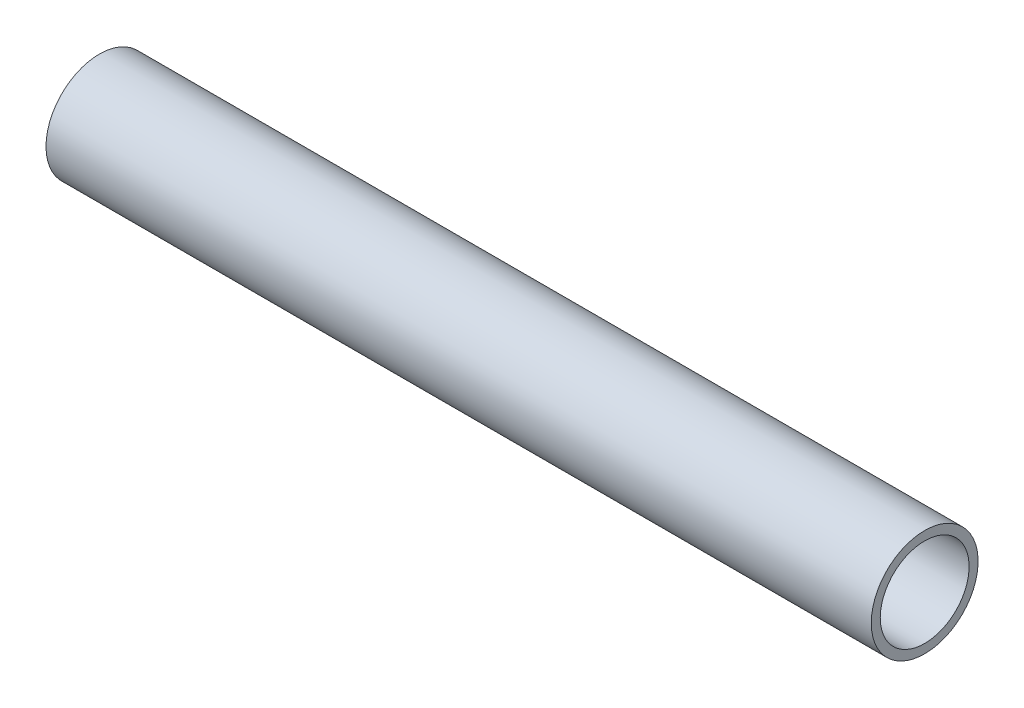
ISO-10303-21;
HEADER;
FILE_DESCRIPTION(('STEP AP214'),'2;1');
FILE_NAME('part.step','',(''),(''),'','','');
FILE_SCHEMA(('AUTOMOTIVE_DESIGN { 1 0 10303 214 1 1 1 1 }'));
ENDSEC;
DATA;
#1=APPLICATION_CONTEXT('core data for automotive mechanical design processes');
#2=APPLICATION_PROTOCOL_DEFINITION('international standard','automotive_design',2000,#1);
#3=PRODUCT_CONTEXT('',#1,'mechanical');
#4=PRODUCT('Part','Part','',(#3));
#5=PRODUCT_RELATED_PRODUCT_CATEGORY('part','',(#4));
#6=PRODUCT_DEFINITION_FORMATION('','',#4);
#7=PRODUCT_DEFINITION_CONTEXT('part definition',#1,'design');
#8=PRODUCT_DEFINITION('design','',#6,#7);
#9=PRODUCT_DEFINITION_SHAPE('','',#8);
#10=(LENGTH_UNIT() NAMED_UNIT(*) SI_UNIT(.MILLI.,.METRE.));
#11=(NAMED_UNIT(*) PLANE_ANGLE_UNIT() SI_UNIT($,.RADIAN.));
#12=(NAMED_UNIT(*) SI_UNIT($,.STERADIAN.) SOLID_ANGLE_UNIT());
#13=UNCERTAINTY_MEASURE_WITH_UNIT(LENGTH_MEASURE(1.E-05),#10,'distance_accuracy_value','');
#14=(GEOMETRIC_REPRESENTATION_CONTEXT(3) GLOBAL_UNCERTAINTY_ASSIGNED_CONTEXT((#13)) GLOBAL_UNIT_ASSIGNED_CONTEXT((#10,
#11,#12)) REPRESENTATION_CONTEXT('',''));
#15=CARTESIAN_POINT('',(0.,0.,0.));
#16=DIRECTION('',(0.,0.,1.));
#17=DIRECTION('',(1.,0.,0.));
#18=AXIS2_PLACEMENT_3D('',#15,#16,#17);
#19=CARTESIAN_POINT('',(25.2027542670464,668.699839019212,0.));
#20=DIRECTION('',(1.,0.,0.));
#21=DIRECTION('',(0.,0.,-1.));
#22=AXIS2_PLACEMENT_3D('',#19,#20,#21);
#23=CYLINDRICAL_SURFACE('',#22,5.28320000000004);
#24=CARTESIAN_POINT('',(25.2027542670464,668.699839019212,0.));
#25=DIRECTION('',(-1.,0.,0.));
#26=DIRECTION('',(0.,0.,1.));
#27=AXIS2_PLACEMENT_3D('',#24,#25,#26);
#28=CIRCLE('',#27,5.28320000000004);
#29=CARTESIAN_POINT('',(25.2027542670464,668.699839019212,5.28320000000004));
#30=VERTEX_POINT('',#29);
#31=EDGE_CURVE('E45',#30,#30,#28,.T.);
#32=ORIENTED_EDGE('',*,*,#31,.T.);
#33=EDGE_LOOP('',(#32));
#34=FACE_BOUND('',#33,.T.);
#35=CARTESIAN_POINT('',(123.301645320245,668.699839019212,0.));
#36=DIRECTION('',(-1.,0.,0.));
#37=DIRECTION('',(0.,0.,1.));
#38=AXIS2_PLACEMENT_3D('',#35,#36,#37);
#39=CIRCLE('',#38,5.28320000000004);
#40=CARTESIAN_POINT('',(123.301645320245,668.699839019212,5.28320000000004));
#41=VERTEX_POINT('',#40);
#42=EDGE_CURVE('E51',#41,#41,#39,.T.);
#43=ORIENTED_EDGE('',*,*,#42,.F.);
#44=EDGE_LOOP('',(#43));
#45=FACE_BOUND('',#44,.T.);
#46=ADVANCED_FACE('F38',(#34,#45),#23,.F.);
#47=CARTESIAN_POINT('',(25.2027542670464,668.699839019212,0.));
#48=DIRECTION('',(1.,0.,0.));
#49=DIRECTION('',(0.,0.,-1.));
#50=AXIS2_PLACEMENT_3D('',#47,#48,#49);
#51=CYLINDRICAL_SURFACE('',#50,6.35000000000005);
#52=CARTESIAN_POINT('',(25.2027542670464,668.699839019212,0.));
#53=DIRECTION('',(-1.,0.,0.));
#54=DIRECTION('',(0.,0.,1.));
#55=AXIS2_PLACEMENT_3D('',#52,#53,#54);
#56=CIRCLE('',#55,6.35000000000005);
#57=CARTESIAN_POINT('',(25.2027542670464,668.699839019212,6.35000000000005));
#58=VERTEX_POINT('',#57);
#59=EDGE_CURVE('E11',#58,#58,#56,.T.);
#60=ORIENTED_EDGE('',*,*,#59,.F.);
#61=EDGE_LOOP('',(#60));
#62=FACE_BOUND('',#61,.T.);
#63=CARTESIAN_POINT('',(123.301645320245,668.699839019212,0.));
#64=DIRECTION('',(-1.,0.,0.));
#65=DIRECTION('',(0.,0.,1.));
#66=AXIS2_PLACEMENT_3D('',#63,#64,#65);
#67=CIRCLE('',#66,6.35000000000005);
#68=CARTESIAN_POINT('',(123.301645320245,668.699839019212,6.35000000000005));
#69=VERTEX_POINT('',#68);
#70=EDGE_CURVE('E41',#69,#69,#67,.T.);
#71=ORIENTED_EDGE('',*,*,#70,.T.);
#72=EDGE_LOOP('',(#71));
#73=FACE_BOUND('',#72,.T.);
#74=ADVANCED_FACE('F58',(#62,#73),#51,.T.);
#75=CARTESIAN_POINT('',(25.2027542670464,668.699839019212,0.));
#76=DIRECTION('',(-1.,0.,0.));
#77=DIRECTION('',(0.,0.,1.));
#78=AXIS2_PLACEMENT_3D('',#75,#76,#77);
#79=PLANE('',#78);
#80=ORIENTED_EDGE('',*,*,#31,.F.);
#81=EDGE_LOOP('',(#80));
#82=FACE_BOUND('',#81,.T.);
#83=ORIENTED_EDGE('',*,*,#59,.T.);
#84=EDGE_LOOP('',(#83));
#85=FACE_BOUND('',#84,.T.);
#86=ADVANCED_FACE('F62',(#82,#85),#79,.T.);
#87=CARTESIAN_POINT('',(123.301645320245,668.699839019212,0.));
#88=DIRECTION('',(-1.,0.,0.));
#89=DIRECTION('',(0.,0.,1.));
#90=AXIS2_PLACEMENT_3D('',#87,#88,#89);
#91=PLANE('',#90);
#92=ORIENTED_EDGE('',*,*,#42,.T.);
#93=EDGE_LOOP('',(#92));
#94=FACE_BOUND('',#93,.T.);
#95=ORIENTED_EDGE('',*,*,#70,.F.);
#96=EDGE_LOOP('',(#95));
#97=FACE_BOUND('',#96,.T.);
#98=ADVANCED_FACE('F60',(#94,#97),#91,.F.);
#99=CLOSED_SHELL('',(#46,#74,#86,#98));
#100=MANIFOLD_SOLID_BREP('B2',#99);
#101=ADVANCED_BREP_SHAPE_REPRESENTATION('',(#18,#100),#14);
#102=SHAPE_DEFINITION_REPRESENTATION(#9,#101);
ENDSEC;
END-ISO-10303-21;
